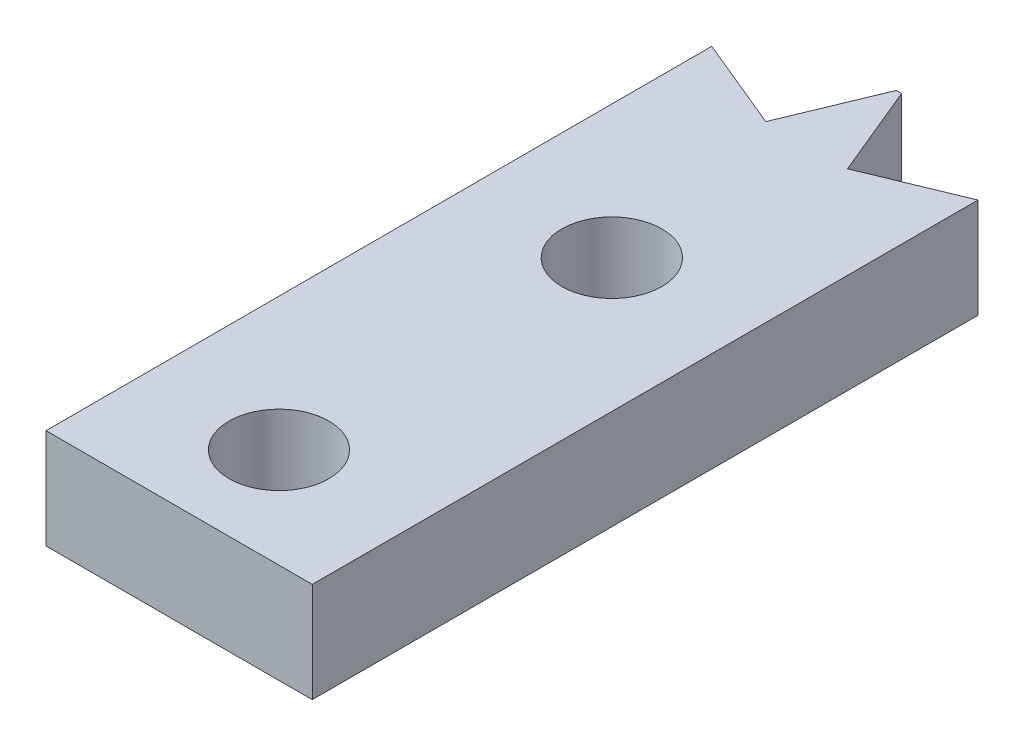
ISO-10303-21;
HEADER;
FILE_DESCRIPTION(('STEP AP214'),'2;1');
FILE_NAME('part.step','',(''),(''),'','','');
FILE_SCHEMA(('AUTOMOTIVE_DESIGN { 1 0 10303 214 1 1 1 1 }'));
ENDSEC;
DATA;
#1=APPLICATION_CONTEXT('core data for automotive mechanical design processes');
#2=APPLICATION_PROTOCOL_DEFINITION('international standard','automotive_design',2000,#1);
#3=PRODUCT_CONTEXT('',#1,'mechanical');
#4=PRODUCT('Part','Part','',(#3));
#5=PRODUCT_RELATED_PRODUCT_CATEGORY('part','',(#4));
#6=PRODUCT_DEFINITION_FORMATION('','',#4);
#7=PRODUCT_DEFINITION_CONTEXT('part definition',#1,'design');
#8=PRODUCT_DEFINITION('design','',#6,#7);
#9=PRODUCT_DEFINITION_SHAPE('','',#8);
#10=(LENGTH_UNIT() NAMED_UNIT(*) SI_UNIT(.MILLI.,.METRE.));
#11=(NAMED_UNIT(*) PLANE_ANGLE_UNIT() SI_UNIT($,.RADIAN.));
#12=(NAMED_UNIT(*) SI_UNIT($,.STERADIAN.) SOLID_ANGLE_UNIT());
#13=UNCERTAINTY_MEASURE_WITH_UNIT(LENGTH_MEASURE(1.E-05),#10,'distance_accuracy_value','');
#14=(GEOMETRIC_REPRESENTATION_CONTEXT(3) GLOBAL_UNCERTAINTY_ASSIGNED_CONTEXT((#13)) GLOBAL_UNIT_ASSIGNED_CONTEXT((#10,
#11,#12)) REPRESENTATION_CONTEXT('',''));
#15=CARTESIAN_POINT('',(0.,0.,0.));
#16=DIRECTION('',(0.,0.,1.));
#17=DIRECTION('',(1.,0.,0.));
#18=AXIS2_PLACEMENT_3D('',#15,#16,#17);
#19=CARTESIAN_POINT('',(0.,3.,0.));
#20=DIRECTION('',(0.,1.,0.));
#21=DIRECTION('',(0.,0.,1.));
#22=AXIS2_PLACEMENT_3D('',#19,#20,#21);
#23=PLANE('',#22);
#24=CARTESIAN_POINT('',(-2.04453169011213,3.,6.65348811857306));
#25=DIRECTION('',(0.,1.,0.));
#26=DIRECTION('',(0.,0.,1.));
#27=AXIS2_PLACEMENT_3D('',#24,#25,#26);
#28=CIRCLE('',#27,1.50214476111209);
#29=CARTESIAN_POINT('',(-2.04453169011213,3.,8.15563287968514));
#30=VERTEX_POINT('',#29);
#31=EDGE_CURVE('E140',#30,#30,#28,.T.);
#32=ORIENTED_EDGE('',*,*,#31,.F.);
#33=EDGE_LOOP('',(#32));
#34=FACE_BOUND('',#33,.T.);
#35=DIRECTION('',(0.,0.,-1.));
#36=VECTOR('',#35,1.);
#37=CARTESIAN_POINT('',(1.95546830988787,3.,-0.347278690242578));
#38=LINE('',#37,#36);
#39=CARTESIAN_POINT('',(1.95546830988787,3.,19.6534881185731));
#40=VERTEX_POINT('',#39);
#41=CARTESIAN_POINT('',(1.95546830988787,3.,-0.347278690242578));
#42=VERTEX_POINT('',#41);
#43=EDGE_CURVE('E53',#40,#42,#38,.T.);
#44=ORIENTED_EDGE('',*,*,#43,.T.);
#45=DIRECTION('',(-0.923879532511286,0.,0.382683432365091));
#46=VECTOR('',#45,1.);
#47=CARTESIAN_POINT('',(1.95546830988787,3.,-0.347278690242578));
#48=LINE('',#47,#46);
#49=CARTESIAN_POINT('',(-0.816170287645994,3.,0.800771606852694));
#50=VERTEX_POINT('',#49);
#51=EDGE_CURVE('E96',#42,#50,#48,.T.);
#52=ORIENTED_EDGE('',*,*,#51,.T.);
#53=DIRECTION('',(-0.382683432365091,0.,-0.923879532511287));
#54=VECTOR('',#53,1.);
#55=CARTESIAN_POINT('',(-0.816170287645994,3.,0.800771606852694));
#56=LINE('',#55,#54);
#57=CARTESIAN_POINT('',(-1.96422058474127,3.,-1.97086699068117));
#58=VERTEX_POINT('',#57);
#59=EDGE_CURVE('E165',#50,#58,#56,.T.);
#60=ORIENTED_EDGE('',*,*,#59,.T.);
#61=DIRECTION('',(-1.,0.,0.));
#62=VECTOR('',#61,1.);
#63=CARTESIAN_POINT('',(-1.96422058474127,3.,-1.97086699068117));
#64=LINE('',#63,#62);
#65=CARTESIAN_POINT('',(-2.12422058474126,3.,-1.97086699068117));
#66=VERTEX_POINT('',#65);
#67=EDGE_CURVE('E179',#58,#66,#64,.T.);
#68=ORIENTED_EDGE('',*,*,#67,.T.);
#69=DIRECTION('',(-0.382683432365091,0.,0.923879532511286));
#70=VECTOR('',#69,1.);
#71=CARTESIAN_POINT('',(-3.27227088183654,3.,0.800771606852692));
#72=LINE('',#71,#70);
#73=CARTESIAN_POINT('',(-3.27227088183654,3.,0.800771606852692));
#74=VERTEX_POINT('',#73);
#75=EDGE_CURVE('E116',#66,#74,#72,.T.);
#76=ORIENTED_EDGE('',*,*,#75,.T.);
#77=DIRECTION('',(-0.923879532511286,0.,-0.38268343236509));
#78=VECTOR('',#77,1.);
#79=CARTESIAN_POINT('',(-6.0439094793704,3.,-0.347278690242579));
#80=LINE('',#79,#78);
#81=CARTESIAN_POINT('',(-6.0439094793704,3.,-0.347278690242579));
#82=VERTEX_POINT('',#81);
#83=EDGE_CURVE('E110',#74,#82,#80,.T.);
#84=ORIENTED_EDGE('',*,*,#83,.T.);
#85=DIRECTION('',(0.,0.,1.));
#86=VECTOR('',#85,1.);
#87=CARTESIAN_POINT('',(-6.0439094793704,3.,4.77772130975742));
#88=LINE('',#87,#86);
#89=CARTESIAN_POINT('',(-6.0439094793704,3.,19.6534881185731));
#90=VERTEX_POINT('',#89);
#91=EDGE_CURVE('E114',#82,#90,#88,.T.);
#92=ORIENTED_EDGE('',*,*,#91,.T.);
#93=DIRECTION('',(1.,0.,0.));
#94=VECTOR('',#93,1.);
#95=CARTESIAN_POINT('',(-6.0439094793704,3.,19.6534881185731));
#96=LINE('',#95,#94);
#97=EDGE_CURVE('E131',#90,#40,#96,.T.);
#98=ORIENTED_EDGE('',*,*,#97,.T.);
#99=EDGE_LOOP('',(#44,#52,#60,#68,#76,#84,#92,#98));
#100=FACE_BOUND('',#99,.T.);
#101=CARTESIAN_POINT('',(-2.04453169011213,3.,16.6534881185731));
#102=DIRECTION('',(0.,1.,0.));
#103=DIRECTION('',(0.,0.,1.));
#104=AXIS2_PLACEMENT_3D('',#101,#102,#103);
#105=CIRCLE('',#104,1.50023536655816);
#106=CARTESIAN_POINT('',(-2.04453169011213,3.,18.1537234851312));
#107=VERTEX_POINT('',#106);
#108=EDGE_CURVE('E188',#107,#107,#105,.T.);
#109=ORIENTED_EDGE('',*,*,#108,.F.);
#110=EDGE_LOOP('',(#109));
#111=FACE_BOUND('',#110,.T.);
#112=ADVANCED_FACE('F36',(#34,#100,#111),#23,.T.);
#113=CARTESIAN_POINT('',(0.,0.,0.));
#114=DIRECTION('',(0.,1.,0.));
#115=DIRECTION('',(0.,0.,1.));
#116=AXIS2_PLACEMENT_3D('',#113,#114,#115);
#117=PLANE('',#116);
#118=DIRECTION('',(-0.923879532511286,0.,0.382683432365091));
#119=VECTOR('',#118,1.);
#120=CARTESIAN_POINT('',(1.95546830988787,0.,-0.347278690242578));
#121=LINE('',#120,#119);
#122=CARTESIAN_POINT('',(1.95546830988787,0.,-0.347278690242578));
#123=VERTEX_POINT('',#122);
#124=CARTESIAN_POINT('',(-0.816170287645994,0.,0.800771606852694));
#125=VERTEX_POINT('',#124);
#126=EDGE_CURVE('E137',#123,#125,#121,.T.);
#127=ORIENTED_EDGE('',*,*,#126,.F.);
#128=DIRECTION('',(0.,0.,-1.));
#129=VECTOR('',#128,1.);
#130=CARTESIAN_POINT('',(1.95546830988787,0.,17.1527213097574));
#131=LINE('',#130,#129);
#132=CARTESIAN_POINT('',(1.95546830988787,0.,19.6534881185731));
#133=VERTEX_POINT('',#132);
#134=EDGE_CURVE('E149',#133,#123,#131,.T.);
#135=ORIENTED_EDGE('',*,*,#134,.F.);
#136=DIRECTION('',(1.,0.,0.));
#137=VECTOR('',#136,1.);
#138=CARTESIAN_POINT('',(-6.0439094793704,0.,19.6534881185731));
#139=LINE('',#138,#137);
#140=CARTESIAN_POINT('',(-6.0439094793704,0.,19.6534881185731));
#141=VERTEX_POINT('',#140);
#142=EDGE_CURVE('E89',#141,#133,#139,.T.);
#143=ORIENTED_EDGE('',*,*,#142,.F.);
#144=DIRECTION('',(0.,0.,1.));
#145=VECTOR('',#144,1.);
#146=CARTESIAN_POINT('',(-6.0439094793704,0.,17.2777213097574));
#147=LINE('',#146,#145);
#148=CARTESIAN_POINT('',(-6.0439094793704,0.,-0.347278690242579));
#149=VERTEX_POINT('',#148);
#150=EDGE_CURVE('E82',#149,#141,#147,.T.);
#151=ORIENTED_EDGE('',*,*,#150,.F.);
#152=DIRECTION('',(-0.923879532511286,0.,-0.38268343236509));
#153=VECTOR('',#152,1.);
#154=CARTESIAN_POINT('',(-6.0439094793704,0.,-0.347278690242579));
#155=LINE('',#154,#153);
#156=CARTESIAN_POINT('',(-3.27227088183654,0.,0.800771606852692));
#157=VERTEX_POINT('',#156);
#158=EDGE_CURVE('E125',#157,#149,#155,.T.);
#159=ORIENTED_EDGE('',*,*,#158,.F.);
#160=DIRECTION('',(-0.382683432365091,0.,0.923879532511286));
#161=VECTOR('',#160,1.);
#162=CARTESIAN_POINT('',(-3.27227088183654,0.,0.800771606852692));
#163=LINE('',#162,#161);
#164=CARTESIAN_POINT('',(-2.12422058474126,0.,-1.97086699068117));
#165=VERTEX_POINT('',#164);
#166=EDGE_CURVE('E144',#165,#157,#163,.T.);
#167=ORIENTED_EDGE('',*,*,#166,.F.);
#168=DIRECTION('',(-1.,0.,0.));
#169=VECTOR('',#168,1.);
#170=CARTESIAN_POINT('',(-1.96422058474127,0.,-1.97086699068117));
#171=LINE('',#170,#169);
#172=CARTESIAN_POINT('',(-1.96422058474127,0.,-1.97086699068117));
#173=VERTEX_POINT('',#172);
#174=EDGE_CURVE('E142',#173,#165,#171,.T.);
#175=ORIENTED_EDGE('',*,*,#174,.F.);
#176=DIRECTION('',(-0.382683432365091,0.,-0.923879532511287));
#177=VECTOR('',#176,1.);
#178=CARTESIAN_POINT('',(-0.816170287645994,0.,0.800771606852694));
#179=LINE('',#178,#177);
#180=EDGE_CURVE('E139',#125,#173,#179,.T.);
#181=ORIENTED_EDGE('',*,*,#180,.F.);
#182=EDGE_LOOP('',(#127,#135,#143,#151,#159,#167,#175,#181));
#183=FACE_BOUND('',#182,.T.);
#184=CARTESIAN_POINT('',(-2.04453169011213,0.,6.65348811857306));
#185=DIRECTION('',(0.,1.,0.));
#186=DIRECTION('',(0.,0.,1.));
#187=AXIS2_PLACEMENT_3D('',#184,#185,#186);
#188=CIRCLE('',#187,1.50214476111209);
#189=CARTESIAN_POINT('',(-2.04453169011213,0.,8.15563287968514));
#190=VERTEX_POINT('',#189);
#191=EDGE_CURVE('E185',#190,#190,#188,.T.);
#192=ORIENTED_EDGE('',*,*,#191,.T.);
#193=EDGE_LOOP('',(#192));
#194=FACE_BOUND('',#193,.T.);
#195=CARTESIAN_POINT('',(-2.04453169011213,0.,16.6534881185731));
#196=DIRECTION('',(0.,1.,0.));
#197=DIRECTION('',(0.,0.,1.));
#198=AXIS2_PLACEMENT_3D('',#195,#196,#197);
#199=CIRCLE('',#198,1.50023536655816);
#200=CARTESIAN_POINT('',(-2.04453169011213,0.,18.1537234851312));
#201=VERTEX_POINT('',#200);
#202=EDGE_CURVE('E191',#201,#201,#199,.T.);
#203=ORIENTED_EDGE('',*,*,#202,.T.);
#204=EDGE_LOOP('',(#203));
#205=FACE_BOUND('',#204,.T.);
#206=ADVANCED_FACE('F169',(#183,#194,#205),#117,.F.);
#207=CARTESIAN_POINT('',(1.95546830988787,3.,-0.347278690242578));
#208=DIRECTION('',(0.382683432365091,0.,0.923879532511287));
#209=DIRECTION('',(0.923879532511287,0.,-0.382683432365091));
#210=AXIS2_PLACEMENT_3D('',#207,#208,#209);
#211=PLANE('',#210);
#212=ORIENTED_EDGE('',*,*,#126,.T.);
#213=DIRECTION('',(0.,-1.,0.));
#214=VECTOR('',#213,1.);
#215=CARTESIAN_POINT('',(-0.816170287645994,3.,0.800771606852694));
#216=LINE('',#215,#214);
#217=EDGE_CURVE('E45',#50,#125,#216,.T.);
#218=ORIENTED_EDGE('',*,*,#217,.F.);
#219=ORIENTED_EDGE('',*,*,#51,.F.);
#220=DIRECTION('',(0.,-1.,0.));
#221=VECTOR('',#220,1.);
#222=CARTESIAN_POINT('',(1.95546830988787,3.,-0.347278690242578));
#223=LINE('',#222,#221);
#224=EDGE_CURVE('E11',#42,#123,#223,.T.);
#225=ORIENTED_EDGE('',*,*,#224,.T.);
#226=EDGE_LOOP('',(#212,#218,#219,#225));
#227=FACE_BOUND('',#226,.T.);
#228=ADVANCED_FACE('F38',(#227),#211,.F.);
#229=CARTESIAN_POINT('',(-0.816170287645994,3.,0.800771606852694));
#230=DIRECTION('',(-0.923879532511286,0.,0.38268343236509));
#231=DIRECTION('',(0.382683432365091,0.,0.923879532511287));
#232=AXIS2_PLACEMENT_3D('',#229,#230,#231);
#233=PLANE('',#232);
#234=ORIENTED_EDGE('',*,*,#180,.T.);
#235=DIRECTION('',(0.,-1.,0.));
#236=VECTOR('',#235,1.);
#237=CARTESIAN_POINT('',(-1.96422058474127,3.,-1.97086699068117));
#238=LINE('',#237,#236);
#239=EDGE_CURVE('E157',#58,#173,#238,.T.);
#240=ORIENTED_EDGE('',*,*,#239,.F.);
#241=ORIENTED_EDGE('',*,*,#59,.F.);
#242=ORIENTED_EDGE('',*,*,#217,.T.);
#243=EDGE_LOOP('',(#234,#240,#241,#242));
#244=FACE_BOUND('',#243,.T.);
#245=ADVANCED_FACE('F163',(#244),#233,.F.);
#246=CARTESIAN_POINT('',(-1.96422058474127,3.,-1.97086699068117));
#247=DIRECTION('',(0.,0.,1.));
#248=DIRECTION('',(1.,0.,0.));
#249=AXIS2_PLACEMENT_3D('',#246,#247,#248);
#250=PLANE('',#249);
#251=ORIENTED_EDGE('',*,*,#174,.T.);
#252=DIRECTION('',(0.,-1.,0.));
#253=VECTOR('',#252,1.);
#254=CARTESIAN_POINT('',(-2.12422058474126,3.,-1.97086699068117));
#255=LINE('',#254,#253);
#256=EDGE_CURVE('E154',#66,#165,#255,.T.);
#257=ORIENTED_EDGE('',*,*,#256,.F.);
#258=ORIENTED_EDGE('',*,*,#67,.F.);
#259=ORIENTED_EDGE('',*,*,#239,.T.);
#260=EDGE_LOOP('',(#251,#257,#258,#259));
#261=FACE_BOUND('',#260,.T.);
#262=ADVANCED_FACE('F175',(#261),#250,.F.);
#263=CARTESIAN_POINT('',(-3.27227088183654,3.,0.800771606852692));
#264=DIRECTION('',(0.923879532511286,0.,0.382683432365091));
#265=DIRECTION('',(0.382683432365091,0.,-0.923879532511287));
#266=AXIS2_PLACEMENT_3D('',#263,#264,#265);
#267=PLANE('',#266);
#268=ORIENTED_EDGE('',*,*,#166,.T.);
#269=DIRECTION('',(0.,-1.,0.));
#270=VECTOR('',#269,1.);
#271=CARTESIAN_POINT('',(-3.27227088183654,3.,0.800771606852692));
#272=LINE('',#271,#270);
#273=EDGE_CURVE('E126',#74,#157,#272,.T.);
#274=ORIENTED_EDGE('',*,*,#273,.F.);
#275=ORIENTED_EDGE('',*,*,#75,.F.);
#276=ORIENTED_EDGE('',*,*,#256,.T.);
#277=EDGE_LOOP('',(#268,#274,#275,#276));
#278=FACE_BOUND('',#277,.T.);
#279=ADVANCED_FACE('F178',(#278),#267,.F.);
#280=CARTESIAN_POINT('',(-6.0439094793704,3.,-0.347278690242579));
#281=DIRECTION('',(-0.38268343236509,0.,0.923879532511287));
#282=DIRECTION('',(0.923879532511287,0.,0.38268343236509));
#283=AXIS2_PLACEMENT_3D('',#280,#281,#282);
#284=PLANE('',#283);
#285=ORIENTED_EDGE('',*,*,#158,.T.);
#286=DIRECTION('',(0.,-1.,0.));
#287=VECTOR('',#286,1.);
#288=CARTESIAN_POINT('',(-6.0439094793704,3.,-0.347278690242579));
#289=LINE('',#288,#287);
#290=EDGE_CURVE('E122',#82,#149,#289,.T.);
#291=ORIENTED_EDGE('',*,*,#290,.F.);
#292=ORIENTED_EDGE('',*,*,#83,.F.);
#293=ORIENTED_EDGE('',*,*,#273,.T.);
#294=EDGE_LOOP('',(#285,#291,#292,#293));
#295=FACE_BOUND('',#294,.T.);
#296=ADVANCED_FACE('F123',(#295),#284,.F.);
#297=CARTESIAN_POINT('',(-6.0439094793704,3.,17.2777213097574));
#298=DIRECTION('',(1.,0.,0.));
#299=DIRECTION('',(0.,0.,-1.));
#300=AXIS2_PLACEMENT_3D('',#297,#298,#299);
#301=PLANE('',#300);
#302=ORIENTED_EDGE('',*,*,#150,.T.);
#303=DIRECTION('',(0.,-1.,0.));
#304=VECTOR('',#303,1.);
#305=CARTESIAN_POINT('',(-6.0439094793704,3.,19.6534881185731));
#306=LINE('',#305,#304);
#307=EDGE_CURVE('E127',#90,#141,#306,.T.);
#308=ORIENTED_EDGE('',*,*,#307,.F.);
#309=ORIENTED_EDGE('',*,*,#91,.F.);
#310=ORIENTED_EDGE('',*,*,#290,.T.);
#311=EDGE_LOOP('',(#302,#308,#309,#310));
#312=FACE_BOUND('',#311,.T.);
#313=ADVANCED_FACE('F129',(#312),#301,.F.);
#314=CARTESIAN_POINT('',(-6.0439094793704,3.,19.6534881185731));
#315=DIRECTION('',(0.,0.,-1.));
#316=DIRECTION('',(-1.,0.,0.));
#317=AXIS2_PLACEMENT_3D('',#314,#315,#316);
#318=PLANE('',#317);
#319=ORIENTED_EDGE('',*,*,#142,.T.);
#320=DIRECTION('',(0.,-1.,0.));
#321=VECTOR('',#320,1.);
#322=CARTESIAN_POINT('',(1.95546830988787,3.,19.6534881185731));
#323=LINE('',#322,#321);
#324=EDGE_CURVE('E133',#40,#133,#323,.T.);
#325=ORIENTED_EDGE('',*,*,#324,.F.);
#326=ORIENTED_EDGE('',*,*,#97,.F.);
#327=ORIENTED_EDGE('',*,*,#307,.T.);
#328=EDGE_LOOP('',(#319,#325,#326,#327));
#329=FACE_BOUND('',#328,.T.);
#330=ADVANCED_FACE('F214',(#329),#318,.F.);
#331=CARTESIAN_POINT('',(1.95546830988787,3.,17.1527213097574));
#332=DIRECTION('',(-1.,0.,0.));
#333=DIRECTION('',(0.,0.,1.));
#334=AXIS2_PLACEMENT_3D('',#331,#332,#333);
#335=PLANE('',#334);
#336=ORIENTED_EDGE('',*,*,#134,.T.);
#337=ORIENTED_EDGE('',*,*,#224,.F.);
#338=ORIENTED_EDGE('',*,*,#43,.F.);
#339=ORIENTED_EDGE('',*,*,#324,.T.);
#340=EDGE_LOOP('',(#336,#337,#338,#339));
#341=FACE_BOUND('',#340,.T.);
#342=ADVANCED_FACE('F211',(#341),#335,.F.);
#343=CARTESIAN_POINT('',(-2.04453169011213,3.,6.65348811857306));
#344=DIRECTION('',(0.,-1.,0.));
#345=DIRECTION('',(0.,0.,-1.));
#346=AXIS2_PLACEMENT_3D('',#343,#344,#345);
#347=CYLINDRICAL_SURFACE('',#346,1.50214476111209);
#348=ORIENTED_EDGE('',*,*,#31,.T.);
#349=EDGE_LOOP('',(#348));
#350=FACE_BOUND('',#349,.T.);
#351=ORIENTED_EDGE('',*,*,#191,.F.);
#352=EDGE_LOOP('',(#351));
#353=FACE_BOUND('',#352,.T.);
#354=ADVANCED_FACE('F208',(#350,#353),#347,.F.);
#355=CARTESIAN_POINT('',(-2.04453169011213,3.,16.6534881185731));
#356=DIRECTION('',(0.,-1.,0.));
#357=DIRECTION('',(0.,0.,-1.));
#358=AXIS2_PLACEMENT_3D('',#355,#356,#357);
#359=CYLINDRICAL_SURFACE('',#358,1.50023536655816);
#360=ORIENTED_EDGE('',*,*,#108,.T.);
#361=EDGE_LOOP('',(#360));
#362=FACE_BOUND('',#361,.T.);
#363=ORIENTED_EDGE('',*,*,#202,.F.);
#364=EDGE_LOOP('',(#363));
#365=FACE_BOUND('',#364,.T.);
#366=ADVANCED_FACE('F197',(#362,#365),#359,.F.);
#367=CLOSED_SHELL('',(#112,#206,#228,#245,#262,#279,#296,#313,#330,#342,#354,#366));
#368=MANIFOLD_SOLID_BREP('B2',#367);
#369=ADVANCED_BREP_SHAPE_REPRESENTATION('',(#18,#368),#14);
#370=SHAPE_DEFINITION_REPRESENTATION(#9,#369);
ENDSEC;
END-ISO-10303-21;
